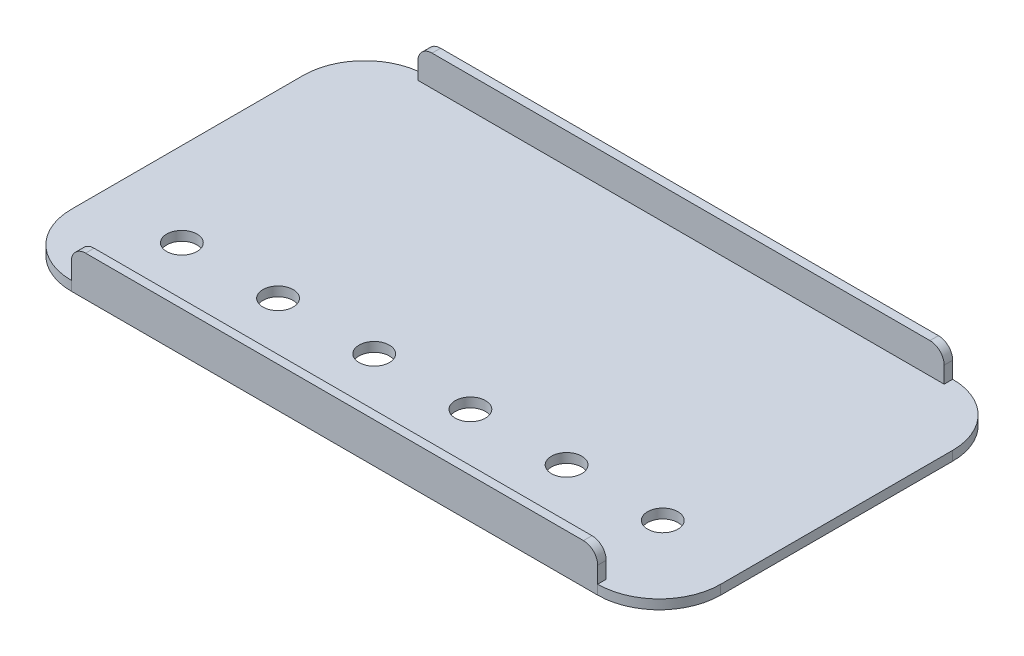
ISO-10303-21;
HEADER;
FILE_DESCRIPTION(('STEP AP214'),'2;1');
FILE_NAME('part.step','',(''),(''),'','','');
FILE_SCHEMA(('AUTOMOTIVE_DESIGN { 1 0 10303 214 1 1 1 1 }'));
ENDSEC;
DATA;
#1=APPLICATION_CONTEXT('core data for automotive mechanical design processes');
#2=APPLICATION_PROTOCOL_DEFINITION('international standard','automotive_design',2000,#1);
#3=PRODUCT_CONTEXT('',#1,'mechanical');
#4=PRODUCT('Part','Part','',(#3));
#5=PRODUCT_RELATED_PRODUCT_CATEGORY('part','',(#4));
#6=PRODUCT_DEFINITION_FORMATION('','',#4);
#7=PRODUCT_DEFINITION_CONTEXT('part definition',#1,'design');
#8=PRODUCT_DEFINITION('design','',#6,#7);
#9=PRODUCT_DEFINITION_SHAPE('','',#8);
#10=(LENGTH_UNIT() NAMED_UNIT(*) SI_UNIT(.MILLI.,.METRE.));
#11=(NAMED_UNIT(*) PLANE_ANGLE_UNIT() SI_UNIT($,.RADIAN.));
#12=(NAMED_UNIT(*) SI_UNIT($,.STERADIAN.) SOLID_ANGLE_UNIT());
#13=UNCERTAINTY_MEASURE_WITH_UNIT(LENGTH_MEASURE(1.E-05),#10,'distance_accuracy_value','');
#14=(GEOMETRIC_REPRESENTATION_CONTEXT(3) GLOBAL_UNCERTAINTY_ASSIGNED_CONTEXT((#13)) GLOBAL_UNIT_ASSIGNED_CONTEXT((#10,
#11,#12)) REPRESENTATION_CONTEXT('',''));
#15=CARTESIAN_POINT('',(0.,0.,0.));
#16=DIRECTION('',(0.,0.,1.));
#17=DIRECTION('',(1.,0.,0.));
#18=AXIS2_PLACEMENT_3D('',#15,#16,#17);
#19=CARTESIAN_POINT('',(-27.8,1.,-12.25));
#20=DIRECTION('',(0.,1.,0.));
#21=DIRECTION('',(0.,0.,1.));
#22=AXIS2_PLACEMENT_3D('',#19,#20,#21);
#23=PLANE('',#22);
#24=CARTESIAN_POINT('',(-25.4,1.,9.4746));
#25=DIRECTION('',(0.,1.,0.));
#26=DIRECTION('',(0.,0.,1.));
#27=AXIS2_PLACEMENT_3D('',#24,#25,#26);
#28=CIRCLE('',#27,1.6);
#29=CARTESIAN_POINT('',(-25.4,1.,11.0746));
#30=VERTEX_POINT('',#29);
#31=EDGE_CURVE('E623',#30,#30,#28,.T.);
#32=ORIENTED_EDGE('',*,*,#31,.F.);
#33=EDGE_LOOP('',(#32));
#34=FACE_BOUND('',#33,.T.);
#35=CARTESIAN_POINT('',(25.4,1.,9.4746));
#36=DIRECTION('',(0.,1.,0.));
#37=DIRECTION('',(0.,0.,1.));
#38=AXIS2_PLACEMENT_3D('',#35,#36,#37);
#39=CIRCLE('',#38,1.6);
#40=CARTESIAN_POINT('',(25.4,1.,11.0746));
#41=VERTEX_POINT('',#40);
#42=EDGE_CURVE('E627',#41,#41,#39,.T.);
#43=ORIENTED_EDGE('',*,*,#42,.F.);
#44=EDGE_LOOP('',(#43));
#45=FACE_BOUND('',#44,.T.);
#46=CARTESIAN_POINT('',(15.24,1.,9.4746));
#47=DIRECTION('',(0.,1.,0.));
#48=DIRECTION('',(0.,0.,1.));
#49=AXIS2_PLACEMENT_3D('',#46,#47,#48);
#50=CIRCLE('',#49,1.6);
#51=CARTESIAN_POINT('',(15.24,1.,11.0746));
#52=VERTEX_POINT('',#51);
#53=EDGE_CURVE('E658',#52,#52,#50,.T.);
#54=ORIENTED_EDGE('',*,*,#53,.F.);
#55=EDGE_LOOP('',(#54));
#56=FACE_BOUND('',#55,.T.);
#57=CARTESIAN_POINT('',(5.08,1.,9.4746));
#58=DIRECTION('',(0.,1.,0.));
#59=DIRECTION('',(0.,0.,1.));
#60=AXIS2_PLACEMENT_3D('',#57,#58,#59);
#61=CIRCLE('',#60,1.6);
#62=CARTESIAN_POINT('',(5.08,1.,11.0746));
#63=VERTEX_POINT('',#62);
#64=EDGE_CURVE('E652',#63,#63,#61,.T.);
#65=ORIENTED_EDGE('',*,*,#64,.F.);
#66=EDGE_LOOP('',(#65));
#67=FACE_BOUND('',#66,.T.);
#68=CARTESIAN_POINT('',(-5.08,1.,9.4746));
#69=DIRECTION('',(0.,1.,0.));
#70=DIRECTION('',(0.,0.,1.));
#71=AXIS2_PLACEMENT_3D('',#68,#69,#70);
#72=CIRCLE('',#71,1.6);
#73=CARTESIAN_POINT('',(-5.08,1.,11.0746));
#74=VERTEX_POINT('',#73);
#75=EDGE_CURVE('E644',#74,#74,#72,.T.);
#76=ORIENTED_EDGE('',*,*,#75,.F.);
#77=EDGE_LOOP('',(#76));
#78=FACE_BOUND('',#77,.T.);
#79=CARTESIAN_POINT('',(-15.24,1.,9.4746));
#80=DIRECTION('',(0.,1.,0.));
#81=DIRECTION('',(0.,0.,1.));
#82=AXIS2_PLACEMENT_3D('',#79,#80,#81);
#83=CIRCLE('',#82,1.6);
#84=CARTESIAN_POINT('',(-15.24,1.,11.0746));
#85=VERTEX_POINT('',#84);
#86=EDGE_CURVE('E635',#85,#85,#83,.T.);
#87=ORIENTED_EDGE('',*,*,#86,.F.);
#88=EDGE_LOOP('',(#87));
#89=FACE_BOUND('',#88,.T.);
#90=DIRECTION('',(1.,0.,0.));
#91=VECTOR('',#90,1.);
#92=CARTESIAN_POINT('',(-27.8,1.,-17.8500000000001));
#93=LINE('',#92,#91);
#94=CARTESIAN_POINT('',(-27.8,1.,-17.8500000000001));
#95=VERTEX_POINT('',#94);
#96=CARTESIAN_POINT('',(27.7999999999999,1.,-17.8500000000001));
#97=VERTEX_POINT('',#96);
#98=EDGE_CURVE('E176',#95,#97,#93,.T.);
#99=ORIENTED_EDGE('',*,*,#98,.F.);
#100=DIRECTION('',(0.,0.,1.));
#101=VECTOR('',#100,1.);
#102=CARTESIAN_POINT('',(-27.7999999999999,1.,-18.75));
#103=LINE('',#102,#101);
#104=CARTESIAN_POINT('',(-27.7999999999999,1.,-18.75));
#105=VERTEX_POINT('',#104);
#106=EDGE_CURVE('E161',#105,#95,#103,.T.);
#107=ORIENTED_EDGE('',*,*,#106,.F.);
#108=CARTESIAN_POINT('',(-27.8,1.,-12.25));
#109=DIRECTION('',(0.,1.,0.));
#110=DIRECTION('',(0.,0.,1.));
#111=AXIS2_PLACEMENT_3D('',#108,#109,#110);
#112=CIRCLE('',#111,6.49999999999999);
#113=CARTESIAN_POINT('',(-34.3,1.,-12.25));
#114=VERTEX_POINT('',#113);
#115=EDGE_CURVE('E172',#105,#114,#112,.T.);
#116=ORIENTED_EDGE('',*,*,#115,.T.);
#117=DIRECTION('',(0.,0.,1.));
#118=VECTOR('',#117,1.);
#119=CARTESIAN_POINT('',(-34.3,1.,12.25));
#120=LINE('',#119,#118);
#121=CARTESIAN_POINT('',(-34.3,1.,12.25));
#122=VERTEX_POINT('',#121);
#123=EDGE_CURVE('E194',#114,#122,#120,.T.);
#124=ORIENTED_EDGE('',*,*,#123,.T.);
#125=CARTESIAN_POINT('',(-27.8,1.,12.25));
#126=DIRECTION('',(0.,1.,0.));
#127=DIRECTION('',(0.,0.,-1.));
#128=AXIS2_PLACEMENT_3D('',#125,#126,#127);
#129=CIRCLE('',#128,6.5);
#130=CARTESIAN_POINT('',(-27.8,1.,18.75));
#131=VERTEX_POINT('',#130);
#132=EDGE_CURVE('E196',#122,#131,#129,.T.);
#133=ORIENTED_EDGE('',*,*,#132,.T.);
#134=DIRECTION('',(0.,0.,1.));
#135=VECTOR('',#134,1.);
#136=CARTESIAN_POINT('',(-27.7999999999999,1.,18.75));
#137=LINE('',#136,#135);
#138=CARTESIAN_POINT('',(-27.8,1.,17.85));
#139=VERTEX_POINT('',#138);
#140=EDGE_CURVE('E166',#139,#131,#137,.T.);
#141=ORIENTED_EDGE('',*,*,#140,.F.);
#142=DIRECTION('',(-1.,0.,0.));
#143=VECTOR('',#142,1.);
#144=CARTESIAN_POINT('',(-27.8,1.,17.85));
#145=LINE('',#144,#143);
#146=CARTESIAN_POINT('',(27.7999999999999,1.,17.85));
#147=VERTEX_POINT('',#146);
#148=EDGE_CURVE('E303',#147,#139,#145,.T.);
#149=ORIENTED_EDGE('',*,*,#148,.F.);
#150=DIRECTION('',(0.,0.,-1.));
#151=VECTOR('',#150,1.);
#152=CARTESIAN_POINT('',(27.7999999999999,1.,18.75));
#153=LINE('',#152,#151);
#154=CARTESIAN_POINT('',(27.7999999999999,1.,18.75));
#155=VERTEX_POINT('',#154);
#156=EDGE_CURVE('E308',#155,#147,#153,.T.);
#157=ORIENTED_EDGE('',*,*,#156,.F.);
#158=CARTESIAN_POINT('',(27.8,1.,12.25));
#159=DIRECTION('',(0.,1.,0.));
#160=DIRECTION('',(0.,0.,1.));
#161=AXIS2_PLACEMENT_3D('',#158,#159,#160);
#162=CIRCLE('',#161,6.5);
#163=CARTESIAN_POINT('',(34.3,1.,12.25));
#164=VERTEX_POINT('',#163);
#165=EDGE_CURVE('E206',#155,#164,#162,.T.);
#166=ORIENTED_EDGE('',*,*,#165,.T.);
#167=DIRECTION('',(0.,0.,-1.));
#168=VECTOR('',#167,1.);
#169=CARTESIAN_POINT('',(34.3,1.,12.25));
#170=LINE('',#169,#168);
#171=CARTESIAN_POINT('',(34.3,1.,-12.25));
#172=VERTEX_POINT('',#171);
#173=EDGE_CURVE('E208',#164,#172,#170,.T.);
#174=ORIENTED_EDGE('',*,*,#173,.T.);
#175=CARTESIAN_POINT('',(27.8,1.,-12.25));
#176=DIRECTION('',(0.,1.,0.));
#177=DIRECTION('',(0.,0.,1.));
#178=AXIS2_PLACEMENT_3D('',#175,#176,#177);
#179=CIRCLE('',#178,6.5);
#180=CARTESIAN_POINT('',(27.7999999999999,1.,-18.75));
#181=VERTEX_POINT('',#180);
#182=EDGE_CURVE('E189',#172,#181,#179,.T.);
#183=ORIENTED_EDGE('',*,*,#182,.T.);
#184=DIRECTION('',(0.,0.,-1.));
#185=VECTOR('',#184,1.);
#186=CARTESIAN_POINT('',(27.7999999999999,1.,-18.75));
#187=LINE('',#186,#185);
#188=EDGE_CURVE('E290',#97,#181,#187,.T.);
#189=ORIENTED_EDGE('',*,*,#188,.F.);
#190=EDGE_LOOP('',(#99,#107,#116,#124,#133,#141,#149,#157,#166,#174,#183,#189));
#191=FACE_BOUND('',#190,.T.);
#192=ADVANCED_FACE('F37',(#34,#45,#56,#67,#78,#89,#191),#23,.T.);
#193=CARTESIAN_POINT('',(-27.8,1.,-12.25));
#194=DIRECTION('',(0.,-1.,0.));
#195=DIRECTION('',(0.,0.,-1.));
#196=AXIS2_PLACEMENT_3D('',#193,#194,#195);
#197=CYLINDRICAL_SURFACE('',#196,6.49999999999999);
#198=CARTESIAN_POINT('',(-27.8,0.,-12.25));
#199=DIRECTION('',(0.,1.,0.));
#200=DIRECTION('',(0.,0.,1.));
#201=AXIS2_PLACEMENT_3D('',#198,#199,#200);
#202=CIRCLE('',#201,6.49999999999999);
#203=CARTESIAN_POINT('',(-27.8,0.,-18.75));
#204=VERTEX_POINT('',#203);
#205=CARTESIAN_POINT('',(-34.3,0.,-12.25));
#206=VERTEX_POINT('',#205);
#207=EDGE_CURVE('E212',#204,#206,#202,.T.);
#208=ORIENTED_EDGE('',*,*,#207,.T.);
#209=DIRECTION('',(0.,-1.,0.));
#210=VECTOR('',#209,1.);
#211=CARTESIAN_POINT('',(-34.3,1.,-12.25));
#212=LINE('',#211,#210);
#213=EDGE_CURVE('E193',#114,#206,#212,.T.);
#214=ORIENTED_EDGE('',*,*,#213,.F.);
#215=ORIENTED_EDGE('',*,*,#115,.F.);
#216=DIRECTION('',(0.,-1.,0.));
#217=VECTOR('',#216,1.);
#218=CARTESIAN_POINT('',(-27.8,1.,-18.75));
#219=LINE('',#218,#217);
#220=EDGE_CURVE('E180',#105,#204,#219,.T.);
#221=ORIENTED_EDGE('',*,*,#220,.T.);
#222=EDGE_LOOP('',(#208,#214,#215,#221));
#223=FACE_BOUND('',#222,.T.);
#224=ADVANCED_FACE('F191',(#223),#197,.T.);
#225=CARTESIAN_POINT('',(-34.3,1.,12.25));
#226=DIRECTION('',(1.,0.,0.));
#227=DIRECTION('',(0.,0.,-1.));
#228=AXIS2_PLACEMENT_3D('',#225,#226,#227);
#229=PLANE('',#228);
#230=DIRECTION('',(0.,0.,1.));
#231=VECTOR('',#230,1.);
#232=CARTESIAN_POINT('',(-34.3,0.,12.25));
#233=LINE('',#232,#231);
#234=CARTESIAN_POINT('',(-34.3,0.,12.25));
#235=VERTEX_POINT('',#234);
#236=EDGE_CURVE('E214',#206,#235,#233,.T.);
#237=ORIENTED_EDGE('',*,*,#236,.T.);
#238=DIRECTION('',(0.,-1.,0.));
#239=VECTOR('',#238,1.);
#240=CARTESIAN_POINT('',(-34.3,1.,12.25));
#241=LINE('',#240,#239);
#242=EDGE_CURVE('E238',#122,#235,#241,.T.);
#243=ORIENTED_EDGE('',*,*,#242,.F.);
#244=ORIENTED_EDGE('',*,*,#123,.F.);
#245=ORIENTED_EDGE('',*,*,#213,.T.);
#246=EDGE_LOOP('',(#237,#243,#244,#245));
#247=FACE_BOUND('',#246,.T.);
#248=ADVANCED_FACE('F372',(#247),#229,.F.);
#249=CARTESIAN_POINT('',(-27.8,1.,12.25));
#250=DIRECTION('',(0.,-1.,0.));
#251=DIRECTION('',(0.,0.,-1.));
#252=AXIS2_PLACEMENT_3D('',#249,#250,#251);
#253=CYLINDRICAL_SURFACE('',#252,6.5);
#254=CARTESIAN_POINT('',(-27.8,0.,12.25));
#255=DIRECTION('',(0.,1.,0.));
#256=DIRECTION('',(0.,0.,-1.));
#257=AXIS2_PLACEMENT_3D('',#254,#255,#256);
#258=CIRCLE('',#257,6.5);
#259=CARTESIAN_POINT('',(-27.8,0.,18.75));
#260=VERTEX_POINT('',#259);
#261=EDGE_CURVE('E216',#235,#260,#258,.T.);
#262=ORIENTED_EDGE('',*,*,#261,.T.);
#263=DIRECTION('',(0.,-1.,0.));
#264=VECTOR('',#263,1.);
#265=CARTESIAN_POINT('',(-27.8,1.,18.75));
#266=LINE('',#265,#264);
#267=EDGE_CURVE('E235',#131,#260,#266,.T.);
#268=ORIENTED_EDGE('',*,*,#267,.F.);
#269=ORIENTED_EDGE('',*,*,#132,.F.);
#270=ORIENTED_EDGE('',*,*,#242,.T.);
#271=EDGE_LOOP('',(#262,#268,#269,#270));
#272=FACE_BOUND('',#271,.T.);
#273=ADVANCED_FACE('F332',(#272),#253,.T.);
#274=CARTESIAN_POINT('',(27.7999999999999,1.,18.75));
#275=DIRECTION('',(0.,0.,-1.));
#276=DIRECTION('',(-1.,0.,0.));
#277=AXIS2_PLACEMENT_3D('',#274,#275,#276);
#278=PLANE('',#277);
#279=DIRECTION('',(0.,-1.,0.));
#280=VECTOR('',#279,1.);
#281=CARTESIAN_POINT('',(27.7999999999999,4.24,18.75));
#282=LINE('',#281,#280);
#283=CARTESIAN_POINT('',(27.7999999999999,2.74,18.75));
#284=VERTEX_POINT('',#283);
#285=EDGE_CURVE('E315',#284,#155,#282,.T.);
#286=ORIENTED_EDGE('',*,*,#285,.F.);
#287=CARTESIAN_POINT('',(26.2999999999999,2.74,18.75));
#288=DIRECTION('',(0.,0.,-1.));
#289=DIRECTION('',(-1.,0.,0.));
#290=AXIS2_PLACEMENT_3D('',#287,#288,#289);
#291=CIRCLE('',#290,1.5);
#292=CARTESIAN_POINT('',(26.2999999999999,4.24,18.75));
#293=VERTEX_POINT('',#292);
#294=EDGE_CURVE('E259',#284,#293,#291,.F.);
#295=ORIENTED_EDGE('',*,*,#294,.T.);
#296=DIRECTION('',(1.,0.,0.));
#297=VECTOR('',#296,1.);
#298=CARTESIAN_POINT('',(-27.7999999999999,4.24,18.75));
#299=LINE('',#298,#297);
#300=CARTESIAN_POINT('',(-26.2999999999999,4.24,18.75));
#301=VERTEX_POINT('',#300);
#302=EDGE_CURVE('E299',#301,#293,#299,.T.);
#303=ORIENTED_EDGE('',*,*,#302,.F.);
#304=CARTESIAN_POINT('',(-26.2999999999999,2.74,18.75));
#305=DIRECTION('',(0.,0.,-1.));
#306=DIRECTION('',(-1.,0.,0.));
#307=AXIS2_PLACEMENT_3D('',#304,#305,#306);
#308=CIRCLE('',#307,1.5);
#309=CARTESIAN_POINT('',(-27.7999999999999,2.74,18.75));
#310=VERTEX_POINT('',#309);
#311=EDGE_CURVE('E245',#301,#310,#308,.F.);
#312=ORIENTED_EDGE('',*,*,#311,.T.);
#313=DIRECTION('',(0.,-1.,0.));
#314=VECTOR('',#313,1.);
#315=CARTESIAN_POINT('',(-27.7999999999999,4.24,18.75));
#316=LINE('',#315,#314);
#317=EDGE_CURVE('E201',#310,#131,#316,.T.);
#318=ORIENTED_EDGE('',*,*,#317,.T.);
#319=ORIENTED_EDGE('',*,*,#267,.T.);
#320=DIRECTION('',(1.,0.,0.));
#321=VECTOR('',#320,1.);
#322=CARTESIAN_POINT('',(27.7999999999999,0.,18.75));
#323=LINE('',#322,#321);
#324=CARTESIAN_POINT('',(27.7999999999999,0.,18.75));
#325=VERTEX_POINT('',#324);
#326=EDGE_CURVE('E218',#260,#325,#323,.T.);
#327=ORIENTED_EDGE('',*,*,#326,.T.);
#328=DIRECTION('',(0.,-1.,0.));
#329=VECTOR('',#328,1.);
#330=CARTESIAN_POINT('',(27.7999999999999,1.,18.75));
#331=LINE('',#330,#329);
#332=EDGE_CURVE('E232',#155,#325,#331,.T.);
#333=ORIENTED_EDGE('',*,*,#332,.F.);
#334=EDGE_LOOP('',(#286,#295,#303,#312,#318,#319,#327,#333));
#335=FACE_BOUND('',#334,.T.);
#336=ADVANCED_FACE('F321',(#335),#278,.F.);
#337=CARTESIAN_POINT('',(27.8,1.,12.25));
#338=DIRECTION('',(0.,-1.,0.));
#339=DIRECTION('',(0.,0.,-1.));
#340=AXIS2_PLACEMENT_3D('',#337,#338,#339);
#341=CYLINDRICAL_SURFACE('',#340,6.5);
#342=CARTESIAN_POINT('',(27.8,0.,12.25));
#343=DIRECTION('',(0.,1.,0.));
#344=DIRECTION('',(0.,0.,1.));
#345=AXIS2_PLACEMENT_3D('',#342,#343,#344);
#346=CIRCLE('',#345,6.5);
#347=CARTESIAN_POINT('',(34.3,0.,12.25));
#348=VERTEX_POINT('',#347);
#349=EDGE_CURVE('E220',#325,#348,#346,.T.);
#350=ORIENTED_EDGE('',*,*,#349,.T.);
#351=DIRECTION('',(0.,-1.,0.));
#352=VECTOR('',#351,1.);
#353=CARTESIAN_POINT('',(34.3,1.,12.25));
#354=LINE('',#353,#352);
#355=EDGE_CURVE('E229',#164,#348,#354,.T.);
#356=ORIENTED_EDGE('',*,*,#355,.F.);
#357=ORIENTED_EDGE('',*,*,#165,.F.);
#358=ORIENTED_EDGE('',*,*,#332,.T.);
#359=EDGE_LOOP('',(#350,#356,#357,#358));
#360=FACE_BOUND('',#359,.T.);
#361=ADVANCED_FACE('F357',(#360),#341,.T.);
#362=CARTESIAN_POINT('',(34.3,1.,12.25));
#363=DIRECTION('',(-1.,0.,0.));
#364=DIRECTION('',(0.,0.,1.));
#365=AXIS2_PLACEMENT_3D('',#362,#363,#364);
#366=PLANE('',#365);
#367=DIRECTION('',(0.,0.,-1.));
#368=VECTOR('',#367,1.);
#369=CARTESIAN_POINT('',(34.3,0.,12.25));
#370=LINE('',#369,#368);
#371=CARTESIAN_POINT('',(34.3,0.,-12.25));
#372=VERTEX_POINT('',#371);
#373=EDGE_CURVE('E222',#348,#372,#370,.T.);
#374=ORIENTED_EDGE('',*,*,#373,.T.);
#375=DIRECTION('',(0.,-1.,0.));
#376=VECTOR('',#375,1.);
#377=CARTESIAN_POINT('',(34.3,1.,-12.25));
#378=LINE('',#377,#376);
#379=EDGE_CURVE('E226',#172,#372,#378,.T.);
#380=ORIENTED_EDGE('',*,*,#379,.F.);
#381=ORIENTED_EDGE('',*,*,#173,.F.);
#382=ORIENTED_EDGE('',*,*,#355,.T.);
#383=EDGE_LOOP('',(#374,#380,#381,#382));
#384=FACE_BOUND('',#383,.T.);
#385=ADVANCED_FACE('F362',(#384),#366,.F.);
#386=CARTESIAN_POINT('',(27.8,1.,-12.25));
#387=DIRECTION('',(0.,-1.,0.));
#388=DIRECTION('',(0.,0.,-1.));
#389=AXIS2_PLACEMENT_3D('',#386,#387,#388);
#390=CYLINDRICAL_SURFACE('',#389,6.5);
#391=CARTESIAN_POINT('',(27.8,0.,-12.25));
#392=DIRECTION('',(0.,1.,0.));
#393=DIRECTION('',(0.,0.,1.));
#394=AXIS2_PLACEMENT_3D('',#391,#392,#393);
#395=CIRCLE('',#394,6.5);
#396=CARTESIAN_POINT('',(27.8,0.,-18.75));
#397=VERTEX_POINT('',#396);
#398=EDGE_CURVE('E198',#372,#397,#395,.T.);
#399=ORIENTED_EDGE('',*,*,#398,.T.);
#400=DIRECTION('',(0.,-1.,0.));
#401=VECTOR('',#400,1.);
#402=CARTESIAN_POINT('',(27.8,1.,-18.75));
#403=LINE('',#402,#401);
#404=EDGE_CURVE('E188',#181,#397,#403,.T.);
#405=ORIENTED_EDGE('',*,*,#404,.F.);
#406=ORIENTED_EDGE('',*,*,#182,.F.);
#407=ORIENTED_EDGE('',*,*,#379,.T.);
#408=EDGE_LOOP('',(#399,#405,#406,#407));
#409=FACE_BOUND('',#408,.T.);
#410=ADVANCED_FACE('F366',(#409),#390,.T.);
#411=CARTESIAN_POINT('',(27.8,1.,-18.75));
#412=DIRECTION('',(0.,0.,1.));
#413=DIRECTION('',(1.,0.,0.));
#414=AXIS2_PLACEMENT_3D('',#411,#412,#413);
#415=PLANE('',#414);
#416=DIRECTION('',(0.,-1.,0.));
#417=VECTOR('',#416,1.);
#418=CARTESIAN_POINT('',(-27.7999999999999,4.24,-18.75));
#419=LINE('',#418,#417);
#420=CARTESIAN_POINT('',(-27.7999999999999,2.74,-18.75));
#421=VERTEX_POINT('',#420);
#422=EDGE_CURVE('E158',#421,#105,#419,.T.);
#423=ORIENTED_EDGE('',*,*,#422,.F.);
#424=CARTESIAN_POINT('',(-26.2999999999999,2.74,-18.75));
#425=DIRECTION('',(0.,0.,1.));
#426=DIRECTION('',(1.,0.,0.));
#427=AXIS2_PLACEMENT_3D('',#424,#425,#426);
#428=CIRCLE('',#427,1.5);
#429=CARTESIAN_POINT('',(-26.2999999999999,4.24,-18.75));
#430=VERTEX_POINT('',#429);
#431=EDGE_CURVE('E11',#421,#430,#428,.F.);
#432=ORIENTED_EDGE('',*,*,#431,.T.);
#433=DIRECTION('',(-1.,0.,0.));
#434=VECTOR('',#433,1.);
#435=CARTESIAN_POINT('',(-27.7999999999999,4.24,-18.75));
#436=LINE('',#435,#434);
#437=CARTESIAN_POINT('',(26.2999999999999,4.24,-18.75));
#438=VERTEX_POINT('',#437);
#439=EDGE_CURVE('E280',#438,#430,#436,.T.);
#440=ORIENTED_EDGE('',*,*,#439,.F.);
#441=CARTESIAN_POINT('',(26.2999999999999,2.74,-18.75));
#442=DIRECTION('',(0.,0.,1.));
#443=DIRECTION('',(1.,0.,0.));
#444=AXIS2_PLACEMENT_3D('',#441,#442,#443);
#445=CIRCLE('',#444,1.5);
#446=CARTESIAN_POINT('',(27.7999999999999,2.74,-18.75));
#447=VERTEX_POINT('',#446);
#448=EDGE_CURVE('E264',#438,#447,#445,.F.);
#449=ORIENTED_EDGE('',*,*,#448,.T.);
#450=DIRECTION('',(0.,-1.,0.));
#451=VECTOR('',#450,1.);
#452=CARTESIAN_POINT('',(27.7999999999999,4.24,-18.75));
#453=LINE('',#452,#451);
#454=EDGE_CURVE('E286',#447,#181,#453,.T.);
#455=ORIENTED_EDGE('',*,*,#454,.T.);
#456=ORIENTED_EDGE('',*,*,#404,.T.);
#457=DIRECTION('',(-1.,0.,0.));
#458=VECTOR('',#457,1.);
#459=CARTESIAN_POINT('',(27.8,0.,-18.75));
#460=LINE('',#459,#458);
#461=EDGE_CURVE('E184',#397,#204,#460,.T.);
#462=ORIENTED_EDGE('',*,*,#461,.T.);
#463=ORIENTED_EDGE('',*,*,#220,.F.);
#464=EDGE_LOOP('',(#423,#432,#440,#449,#455,#456,#462,#463));
#465=FACE_BOUND('',#464,.T.);
#466=ADVANCED_FACE('F181',(#465),#415,.F.);
#467=CARTESIAN_POINT('',(-27.8,0.,-12.25));
#468=DIRECTION('',(0.,1.,0.));
#469=DIRECTION('',(0.,0.,1.));
#470=AXIS2_PLACEMENT_3D('',#467,#468,#469);
#471=PLANE('',#470);
#472=CARTESIAN_POINT('',(-25.4,0.,9.4746));
#473=DIRECTION('',(0.,1.,0.));
#474=DIRECTION('',(0.,0.,1.));
#475=AXIS2_PLACEMENT_3D('',#472,#473,#474);
#476=CIRCLE('',#475,1.6);
#477=CARTESIAN_POINT('',(-25.4,0.,11.0746));
#478=VERTEX_POINT('',#477);
#479=EDGE_CURVE('E626',#478,#478,#476,.F.);
#480=ORIENTED_EDGE('',*,*,#479,.F.);
#481=EDGE_LOOP('',(#480));
#482=FACE_BOUND('',#481,.T.);
#483=CARTESIAN_POINT('',(25.4,0.,9.4746));
#484=DIRECTION('',(0.,1.,0.));
#485=DIRECTION('',(0.,0.,1.));
#486=AXIS2_PLACEMENT_3D('',#483,#484,#485);
#487=CIRCLE('',#486,1.6);
#488=CARTESIAN_POINT('',(25.4,0.,11.0746));
#489=VERTEX_POINT('',#488);
#490=EDGE_CURVE('E630',#489,#489,#487,.F.);
#491=ORIENTED_EDGE('',*,*,#490,.F.);
#492=EDGE_LOOP('',(#491));
#493=FACE_BOUND('',#492,.T.);
#494=CARTESIAN_POINT('',(15.24,0.,9.4746));
#495=DIRECTION('',(0.,1.,0.));
#496=DIRECTION('',(0.,0.,1.));
#497=AXIS2_PLACEMENT_3D('',#494,#495,#496);
#498=CIRCLE('',#497,1.6);
#499=CARTESIAN_POINT('',(15.24,0.,11.0746));
#500=VERTEX_POINT('',#499);
#501=EDGE_CURVE('E655',#500,#500,#498,.F.);
#502=ORIENTED_EDGE('',*,*,#501,.F.);
#503=EDGE_LOOP('',(#502));
#504=FACE_BOUND('',#503,.T.);
#505=CARTESIAN_POINT('',(5.08,0.,9.4746));
#506=DIRECTION('',(0.,1.,0.));
#507=DIRECTION('',(0.,0.,1.));
#508=AXIS2_PLACEMENT_3D('',#505,#506,#507);
#509=CIRCLE('',#508,1.6);
#510=CARTESIAN_POINT('',(5.08,0.,11.0746));
#511=VERTEX_POINT('',#510);
#512=EDGE_CURVE('E649',#511,#511,#509,.F.);
#513=ORIENTED_EDGE('',*,*,#512,.F.);
#514=EDGE_LOOP('',(#513));
#515=FACE_BOUND('',#514,.T.);
#516=CARTESIAN_POINT('',(-5.08,0.,9.4746));
#517=DIRECTION('',(0.,1.,0.));
#518=DIRECTION('',(0.,0.,1.));
#519=AXIS2_PLACEMENT_3D('',#516,#517,#518);
#520=CIRCLE('',#519,1.6);
#521=CARTESIAN_POINT('',(-5.08,0.,11.0746));
#522=VERTEX_POINT('',#521);
#523=EDGE_CURVE('E637',#522,#522,#520,.F.);
#524=ORIENTED_EDGE('',*,*,#523,.F.);
#525=EDGE_LOOP('',(#524));
#526=FACE_BOUND('',#525,.T.);
#527=CARTESIAN_POINT('',(-15.24,0.,9.4746));
#528=DIRECTION('',(0.,1.,0.));
#529=DIRECTION('',(0.,0.,1.));
#530=AXIS2_PLACEMENT_3D('',#527,#528,#529);
#531=CIRCLE('',#530,1.6);
#532=CARTESIAN_POINT('',(-15.24,0.,11.0746));
#533=VERTEX_POINT('',#532);
#534=EDGE_CURVE('E177',#533,#533,#531,.F.);
#535=ORIENTED_EDGE('',*,*,#534,.F.);
#536=EDGE_LOOP('',(#535));
#537=FACE_BOUND('',#536,.T.);
#538=ORIENTED_EDGE('',*,*,#207,.F.);
#539=ORIENTED_EDGE('',*,*,#461,.F.);
#540=ORIENTED_EDGE('',*,*,#398,.F.);
#541=ORIENTED_EDGE('',*,*,#373,.F.);
#542=ORIENTED_EDGE('',*,*,#349,.F.);
#543=ORIENTED_EDGE('',*,*,#326,.F.);
#544=ORIENTED_EDGE('',*,*,#261,.F.);
#545=ORIENTED_EDGE('',*,*,#236,.F.);
#546=EDGE_LOOP('',(#538,#539,#540,#541,#542,#543,#544,#545));
#547=FACE_BOUND('',#546,.T.);
#548=ADVANCED_FACE('F370',(#482,#493,#504,#515,#526,#537,#547),#471,.F.);
#549=CARTESIAN_POINT('',(-27.7999999999999,4.24,18.75));
#550=DIRECTION('',(1.,0.,0.));
#551=DIRECTION('',(0.,0.,-1.));
#552=AXIS2_PLACEMENT_3D('',#549,#550,#551);
#553=PLANE('',#552);
#554=ORIENTED_EDGE('',*,*,#317,.F.);
#555=DIRECTION('',(0.,0.,1.));
#556=VECTOR('',#555,1.);
#557=CARTESIAN_POINT('',(-27.7999999999999,2.74,18.75));
#558=LINE('',#557,#556);
#559=CARTESIAN_POINT('',(-27.8,2.74,17.85));
#560=VERTEX_POINT('',#559);
#561=EDGE_CURVE('E247',#310,#560,#558,.F.);
#562=ORIENTED_EDGE('',*,*,#561,.T.);
#563=DIRECTION('',(0.,-1.,0.));
#564=VECTOR('',#563,1.);
#565=CARTESIAN_POINT('',(-27.8,4.24,17.85));
#566=LINE('',#565,#564);
#567=EDGE_CURVE('E305',#560,#139,#566,.T.);
#568=ORIENTED_EDGE('',*,*,#567,.T.);
#569=ORIENTED_EDGE('',*,*,#140,.T.);
#570=EDGE_LOOP('',(#554,#562,#568,#569));
#571=FACE_BOUND('',#570,.T.);
#572=ADVANCED_FACE('F334',(#571),#553,.F.);
#573=CARTESIAN_POINT('',(27.7999999999999,4.24,18.75));
#574=DIRECTION('',(-1.,0.,0.));
#575=DIRECTION('',(0.,0.,1.));
#576=AXIS2_PLACEMENT_3D('',#573,#574,#575);
#577=PLANE('',#576);
#578=DIRECTION('',(0.,-1.,0.));
#579=VECTOR('',#578,1.);
#580=CARTESIAN_POINT('',(27.7999999999999,4.24,17.85));
#581=LINE('',#580,#579);
#582=CARTESIAN_POINT('',(27.7999999999999,2.74,17.85));
#583=VERTEX_POINT('',#582);
#584=EDGE_CURVE('E314',#583,#147,#581,.T.);
#585=ORIENTED_EDGE('',*,*,#584,.F.);
#586=DIRECTION('',(0.,0.,-1.));
#587=VECTOR('',#586,1.);
#588=CARTESIAN_POINT('',(27.7999999999999,2.74,18.75));
#589=LINE('',#588,#587);
#590=EDGE_CURVE('E257',#583,#284,#589,.F.);
#591=ORIENTED_EDGE('',*,*,#590,.T.);
#592=ORIENTED_EDGE('',*,*,#285,.T.);
#593=ORIENTED_EDGE('',*,*,#156,.T.);
#594=EDGE_LOOP('',(#585,#591,#592,#593));
#595=FACE_BOUND('',#594,.T.);
#596=ADVANCED_FACE('F352',(#595),#577,.F.);
#597=CARTESIAN_POINT('',(-27.8,4.24,17.85));
#598=DIRECTION('',(0.,0.,1.));
#599=DIRECTION('',(1.,0.,0.));
#600=AXIS2_PLACEMENT_3D('',#597,#598,#599);
#601=PLANE('',#600);
#602=DIRECTION('',(-1.,0.,0.));
#603=VECTOR('',#602,1.);
#604=CARTESIAN_POINT('',(-27.8,4.24,17.85));
#605=LINE('',#604,#603);
#606=CARTESIAN_POINT('',(26.2999999999999,4.24,17.85));
#607=VERTEX_POINT('',#606);
#608=CARTESIAN_POINT('',(-26.3,4.24,17.85));
#609=VERTEX_POINT('',#608);
#610=EDGE_CURVE('E302',#607,#609,#605,.T.);
#611=ORIENTED_EDGE('',*,*,#610,.F.);
#612=CARTESIAN_POINT('',(26.2999999999999,2.74,17.85));
#613=DIRECTION('',(0.,0.,1.));
#614=DIRECTION('',(1.,0.,0.));
#615=AXIS2_PLACEMENT_3D('',#612,#613,#614);
#616=CIRCLE('',#615,1.5);
#617=EDGE_CURVE('E255',#607,#583,#616,.F.);
#618=ORIENTED_EDGE('',*,*,#617,.T.);
#619=ORIENTED_EDGE('',*,*,#584,.T.);
#620=ORIENTED_EDGE('',*,*,#148,.T.);
#621=ORIENTED_EDGE('',*,*,#567,.F.);
#622=CARTESIAN_POINT('',(-26.3,2.74,17.85));
#623=DIRECTION('',(0.,0.,1.));
#624=DIRECTION('',(1.,0.,0.));
#625=AXIS2_PLACEMENT_3D('',#622,#623,#624);
#626=CIRCLE('',#625,1.5);
#627=EDGE_CURVE('E249',#560,#609,#626,.F.);
#628=ORIENTED_EDGE('',*,*,#627,.T.);
#629=EDGE_LOOP('',(#611,#618,#619,#620,#621,#628));
#630=FACE_BOUND('',#629,.T.);
#631=ADVANCED_FACE('F339',(#630),#601,.F.);
#632=CARTESIAN_POINT('',(0.,4.24,0.));
#633=DIRECTION('',(0.,-1.,0.));
#634=DIRECTION('',(0.,0.,-1.));
#635=AXIS2_PLACEMENT_3D('',#632,#633,#634);
#636=PLANE('',#635);
#637=ORIENTED_EDGE('',*,*,#302,.T.);
#638=DIRECTION('',(0.,0.,-1.));
#639=VECTOR('',#638,1.);
#640=CARTESIAN_POINT('',(26.2999999999999,4.24,-1.01384949818199E-13));
#641=LINE('',#640,#639);
#642=EDGE_CURVE('E252',#293,#607,#641,.T.);
#643=ORIENTED_EDGE('',*,*,#642,.T.);
#644=ORIENTED_EDGE('',*,*,#610,.T.);
#645=DIRECTION('',(0.,0.,1.));
#646=VECTOR('',#645,1.);
#647=CARTESIAN_POINT('',(-26.3000000000004,4.24,6.08309698909208E-13));
#648=LINE('',#647,#646);
#649=EDGE_CURVE('E242',#609,#301,#648,.T.);
#650=ORIENTED_EDGE('',*,*,#649,.T.);
#651=EDGE_LOOP('',(#637,#643,#644,#650));
#652=FACE_BOUND('',#651,.T.);
#653=ADVANCED_FACE('F344',(#652),#636,.F.);
#654=CARTESIAN_POINT('',(-27.7999999999999,4.24,-18.75));
#655=DIRECTION('',(1.,0.,0.));
#656=DIRECTION('',(0.,0.,-1.));
#657=AXIS2_PLACEMENT_3D('',#654,#655,#656);
#658=PLANE('',#657);
#659=DIRECTION('',(0.,-1.,0.));
#660=VECTOR('',#659,1.);
#661=CARTESIAN_POINT('',(-27.8,4.24,-17.8500000000001));
#662=LINE('',#661,#660);
#663=CARTESIAN_POINT('',(-27.8,2.74,-17.8500000000001));
#664=VERTEX_POINT('',#663);
#665=EDGE_CURVE('E167',#664,#95,#662,.T.);
#666=ORIENTED_EDGE('',*,*,#665,.F.);
#667=DIRECTION('',(0.,0.,1.));
#668=VECTOR('',#667,1.);
#669=CARTESIAN_POINT('',(-27.7999999999999,2.74,-18.75));
#670=LINE('',#669,#668);
#671=EDGE_CURVE('E45',#664,#421,#670,.F.);
#672=ORIENTED_EDGE('',*,*,#671,.T.);
#673=ORIENTED_EDGE('',*,*,#422,.T.);
#674=ORIENTED_EDGE('',*,*,#106,.T.);
#675=EDGE_LOOP('',(#666,#672,#673,#674));
#676=FACE_BOUND('',#675,.T.);
#677=ADVANCED_FACE('F160',(#676),#658,.F.);
#678=CARTESIAN_POINT('',(-27.8,4.24,-17.8500000000001));
#679=DIRECTION('',(0.,0.,-1.));
#680=DIRECTION('',(-1.,0.,0.));
#681=AXIS2_PLACEMENT_3D('',#678,#679,#680);
#682=PLANE('',#681);
#683=DIRECTION('',(1.,0.,0.));
#684=VECTOR('',#683,1.);
#685=CARTESIAN_POINT('',(-27.8,4.24,-17.8500000000001));
#686=LINE('',#685,#684);
#687=CARTESIAN_POINT('',(-26.3,4.24,-17.8500000000001));
#688=VERTEX_POINT('',#687);
#689=CARTESIAN_POINT('',(26.2999999999999,4.24,-17.8500000000001));
#690=VERTEX_POINT('',#689);
#691=EDGE_CURVE('E278',#688,#690,#686,.T.);
#692=ORIENTED_EDGE('',*,*,#691,.F.);
#693=CARTESIAN_POINT('',(-26.3,2.74,-17.8500000000001));
#694=DIRECTION('',(0.,0.,-1.));
#695=DIRECTION('',(-1.,0.,0.));
#696=AXIS2_PLACEMENT_3D('',#693,#694,#695);
#697=CIRCLE('',#696,1.5);
#698=EDGE_CURVE('E59',#688,#664,#697,.F.);
#699=ORIENTED_EDGE('',*,*,#698,.T.);
#700=ORIENTED_EDGE('',*,*,#665,.T.);
#701=ORIENTED_EDGE('',*,*,#98,.T.);
#702=DIRECTION('',(0.,-1.,0.));
#703=VECTOR('',#702,1.);
#704=CARTESIAN_POINT('',(27.7999999999999,4.24,-17.8500000000001));
#705=LINE('',#704,#703);
#706=CARTESIAN_POINT('',(27.7999999999999,2.74,-17.8500000000001));
#707=VERTEX_POINT('',#706);
#708=EDGE_CURVE('E288',#707,#97,#705,.T.);
#709=ORIENTED_EDGE('',*,*,#708,.F.);
#710=CARTESIAN_POINT('',(26.2999999999999,2.74,-17.8500000000001));
#711=DIRECTION('',(0.,0.,-1.));
#712=DIRECTION('',(-1.,0.,0.));
#713=AXIS2_PLACEMENT_3D('',#710,#711,#712);
#714=CIRCLE('',#713,1.5);
#715=EDGE_CURVE('E268',#707,#690,#714,.F.);
#716=ORIENTED_EDGE('',*,*,#715,.T.);
#717=EDGE_LOOP('',(#692,#699,#700,#701,#709,#716));
#718=FACE_BOUND('',#717,.T.);
#719=ADVANCED_FACE('F282',(#718),#682,.F.);
#720=CARTESIAN_POINT('',(27.7999999999999,4.24,-18.75));
#721=DIRECTION('',(-1.,0.,0.));
#722=DIRECTION('',(0.,0.,1.));
#723=AXIS2_PLACEMENT_3D('',#720,#721,#722);
#724=PLANE('',#723);
#725=ORIENTED_EDGE('',*,*,#454,.F.);
#726=DIRECTION('',(0.,0.,-1.));
#727=VECTOR('',#726,1.);
#728=CARTESIAN_POINT('',(27.7999999999999,2.74,-18.75));
#729=LINE('',#728,#727);
#730=EDGE_CURVE('E266',#447,#707,#729,.F.);
#731=ORIENTED_EDGE('',*,*,#730,.T.);
#732=ORIENTED_EDGE('',*,*,#708,.T.);
#733=ORIENTED_EDGE('',*,*,#188,.T.);
#734=EDGE_LOOP('',(#725,#731,#732,#733));
#735=FACE_BOUND('',#734,.T.);
#736=ADVANCED_FACE('F466',(#735),#724,.F.);
#737=CARTESIAN_POINT('',(0.,4.24,0.));
#738=DIRECTION('',(0.,-1.,0.));
#739=DIRECTION('',(0.,0.,-1.));
#740=AXIS2_PLACEMENT_3D('',#737,#738,#739);
#741=PLANE('',#740);
#742=ORIENTED_EDGE('',*,*,#439,.T.);
#743=DIRECTION('',(0.,0.,1.));
#744=VECTOR('',#743,1.);
#745=CARTESIAN_POINT('',(-26.3000000000004,4.24,-6.08309698909213E-13));
#746=LINE('',#745,#744);
#747=EDGE_CURVE('E271',#430,#688,#746,.T.);
#748=ORIENTED_EDGE('',*,*,#747,.T.);
#749=ORIENTED_EDGE('',*,*,#691,.T.);
#750=DIRECTION('',(0.,0.,-1.));
#751=VECTOR('',#750,1.);
#752=CARTESIAN_POINT('',(26.2999999999999,4.24,1.013849498182E-13));
#753=LINE('',#752,#751);
#754=EDGE_CURVE('E261',#690,#438,#753,.T.);
#755=ORIENTED_EDGE('',*,*,#754,.T.);
#756=EDGE_LOOP('',(#742,#748,#749,#755));
#757=FACE_BOUND('',#756,.T.);
#758=ADVANCED_FACE('F277',(#757),#741,.F.);
#759=CARTESIAN_POINT('',(-26.3000000000004,2.74,6.08309698909208E-13));
#760=DIRECTION('',(0.,0.,1.));
#761=DIRECTION('',(1.,0.,0.));
#762=AXIS2_PLACEMENT_3D('',#759,#760,#761);
#763=CYLINDRICAL_SURFACE('',#762,1.5);
#764=ORIENTED_EDGE('',*,*,#627,.F.);
#765=ORIENTED_EDGE('',*,*,#561,.F.);
#766=ORIENTED_EDGE('',*,*,#311,.F.);
#767=ORIENTED_EDGE('',*,*,#649,.F.);
#768=EDGE_LOOP('',(#764,#765,#766,#767));
#769=FACE_BOUND('',#768,.T.);
#770=ADVANCED_FACE('F342',(#769),#763,.T.);
#771=CARTESIAN_POINT('',(26.2999999999999,2.74,-1.01384949818199E-13));
#772=DIRECTION('',(0.,0.,-1.));
#773=DIRECTION('',(-1.,0.,0.));
#774=AXIS2_PLACEMENT_3D('',#771,#772,#773);
#775=CYLINDRICAL_SURFACE('',#774,1.5);
#776=ORIENTED_EDGE('',*,*,#294,.F.);
#777=ORIENTED_EDGE('',*,*,#590,.F.);
#778=ORIENTED_EDGE('',*,*,#617,.F.);
#779=ORIENTED_EDGE('',*,*,#642,.F.);
#780=EDGE_LOOP('',(#776,#777,#778,#779));
#781=FACE_BOUND('',#780,.T.);
#782=ADVANCED_FACE('F350',(#781),#775,.T.);
#783=CARTESIAN_POINT('',(26.2999999999999,2.74,1.013849498182E-13));
#784=DIRECTION('',(0.,0.,-1.));
#785=DIRECTION('',(-1.,0.,0.));
#786=AXIS2_PLACEMENT_3D('',#783,#784,#785);
#787=CYLINDRICAL_SURFACE('',#786,1.5);
#788=ORIENTED_EDGE('',*,*,#715,.F.);
#789=ORIENTED_EDGE('',*,*,#730,.F.);
#790=ORIENTED_EDGE('',*,*,#448,.F.);
#791=ORIENTED_EDGE('',*,*,#754,.F.);
#792=EDGE_LOOP('',(#788,#789,#790,#791));
#793=FACE_BOUND('',#792,.T.);
#794=ADVANCED_FACE('F491',(#793),#787,.T.);
#795=CARTESIAN_POINT('',(-26.3000000000004,2.74,-6.08309698909213E-13));
#796=DIRECTION('',(0.,0.,1.));
#797=DIRECTION('',(1.,0.,0.));
#798=AXIS2_PLACEMENT_3D('',#795,#796,#797);
#799=CYLINDRICAL_SURFACE('',#798,1.5);
#800=ORIENTED_EDGE('',*,*,#431,.F.);
#801=ORIENTED_EDGE('',*,*,#671,.F.);
#802=ORIENTED_EDGE('',*,*,#698,.F.);
#803=ORIENTED_EDGE('',*,*,#747,.F.);
#804=EDGE_LOOP('',(#800,#801,#802,#803));
#805=FACE_BOUND('',#804,.T.);
#806=ADVANCED_FACE('F39',(#805),#799,.T.);
#807=CARTESIAN_POINT('',(-15.24,-0.000999999999999916,9.4746));
#808=DIRECTION('',(0.,1.,0.));
#809=DIRECTION('',(0.,0.,1.));
#810=AXIS2_PLACEMENT_3D('',#807,#808,#809);
#811=CYLINDRICAL_SURFACE('',#810,1.6);
#812=ORIENTED_EDGE('',*,*,#86,.T.);
#813=EDGE_LOOP('',(#812));
#814=FACE_BOUND('',#813,.T.);
#815=ORIENTED_EDGE('',*,*,#534,.T.);
#816=EDGE_LOOP('',(#815));
#817=FACE_BOUND('',#816,.T.);
#818=ADVANCED_FACE('F502',(#814,#817),#811,.F.);
#819=CARTESIAN_POINT('',(-5.08,-0.000999999999999916,9.4746));
#820=DIRECTION('',(0.,1.,0.));
#821=DIRECTION('',(0.,0.,1.));
#822=AXIS2_PLACEMENT_3D('',#819,#820,#821);
#823=CYLINDRICAL_SURFACE('',#822,1.6);
#824=ORIENTED_EDGE('',*,*,#75,.T.);
#825=EDGE_LOOP('',(#824));
#826=FACE_BOUND('',#825,.T.);
#827=ORIENTED_EDGE('',*,*,#523,.T.);
#828=EDGE_LOOP('',(#827));
#829=FACE_BOUND('',#828,.T.);
#830=ADVANCED_FACE('F507',(#826,#829),#823,.F.);
#831=CARTESIAN_POINT('',(5.08,-0.000999999999999916,9.4746));
#832=DIRECTION('',(0.,1.,0.));
#833=DIRECTION('',(0.,0.,1.));
#834=AXIS2_PLACEMENT_3D('',#831,#832,#833);
#835=CYLINDRICAL_SURFACE('',#834,1.6);
#836=ORIENTED_EDGE('',*,*,#64,.T.);
#837=EDGE_LOOP('',(#836));
#838=FACE_BOUND('',#837,.T.);
#839=ORIENTED_EDGE('',*,*,#512,.T.);
#840=EDGE_LOOP('',(#839));
#841=FACE_BOUND('',#840,.T.);
#842=ADVANCED_FACE('F515',(#838,#841),#835,.F.);
#843=CARTESIAN_POINT('',(15.24,-0.000999999999999916,9.4746));
#844=DIRECTION('',(0.,1.,0.));
#845=DIRECTION('',(0.,0.,1.));
#846=AXIS2_PLACEMENT_3D('',#843,#844,#845);
#847=CYLINDRICAL_SURFACE('',#846,1.6);
#848=ORIENTED_EDGE('',*,*,#53,.T.);
#849=EDGE_LOOP('',(#848));
#850=FACE_BOUND('',#849,.T.);
#851=ORIENTED_EDGE('',*,*,#501,.T.);
#852=EDGE_LOOP('',(#851));
#853=FACE_BOUND('',#852,.T.);
#854=ADVANCED_FACE('F523',(#850,#853),#847,.F.);
#855=CARTESIAN_POINT('',(25.4,-0.000999999999999916,9.4746));
#856=DIRECTION('',(0.,1.,0.));
#857=DIRECTION('',(0.,0.,1.));
#858=AXIS2_PLACEMENT_3D('',#855,#856,#857);
#859=CYLINDRICAL_SURFACE('',#858,1.6);
#860=ORIENTED_EDGE('',*,*,#42,.T.);
#861=EDGE_LOOP('',(#860));
#862=FACE_BOUND('',#861,.T.);
#863=ORIENTED_EDGE('',*,*,#490,.T.);
#864=EDGE_LOOP('',(#863));
#865=FACE_BOUND('',#864,.T.);
#866=ADVANCED_FACE('F531',(#862,#865),#859,.F.);
#867=CARTESIAN_POINT('',(-25.4,-0.000999999999999916,9.4746));
#868=DIRECTION('',(0.,1.,0.));
#869=DIRECTION('',(0.,0.,1.));
#870=AXIS2_PLACEMENT_3D('',#867,#868,#869);
#871=CYLINDRICAL_SURFACE('',#870,1.6);
#872=ORIENTED_EDGE('',*,*,#31,.T.);
#873=EDGE_LOOP('',(#872));
#874=FACE_BOUND('',#873,.T.);
#875=ORIENTED_EDGE('',*,*,#479,.T.);
#876=EDGE_LOOP('',(#875));
#877=FACE_BOUND('',#876,.T.);
#878=ADVANCED_FACE('F539',(#874,#877),#871,.F.);
#879=CLOSED_SHELL('',(#192,#224,#248,#273,#336,#361,#385,#410,#466,#548,#572,#596,#631,#653,
#677,#719,#736,#758,#770,#782,#794,#806,#818,#830,#842,#854,#866,#878));
#880=MANIFOLD_SOLID_BREP('B2',#879);
#881=ADVANCED_BREP_SHAPE_REPRESENTATION('',(#18,#880),#14);
#882=SHAPE_DEFINITION_REPRESENTATION(#9,#881);
ENDSEC;
END-ISO-10303-21;
